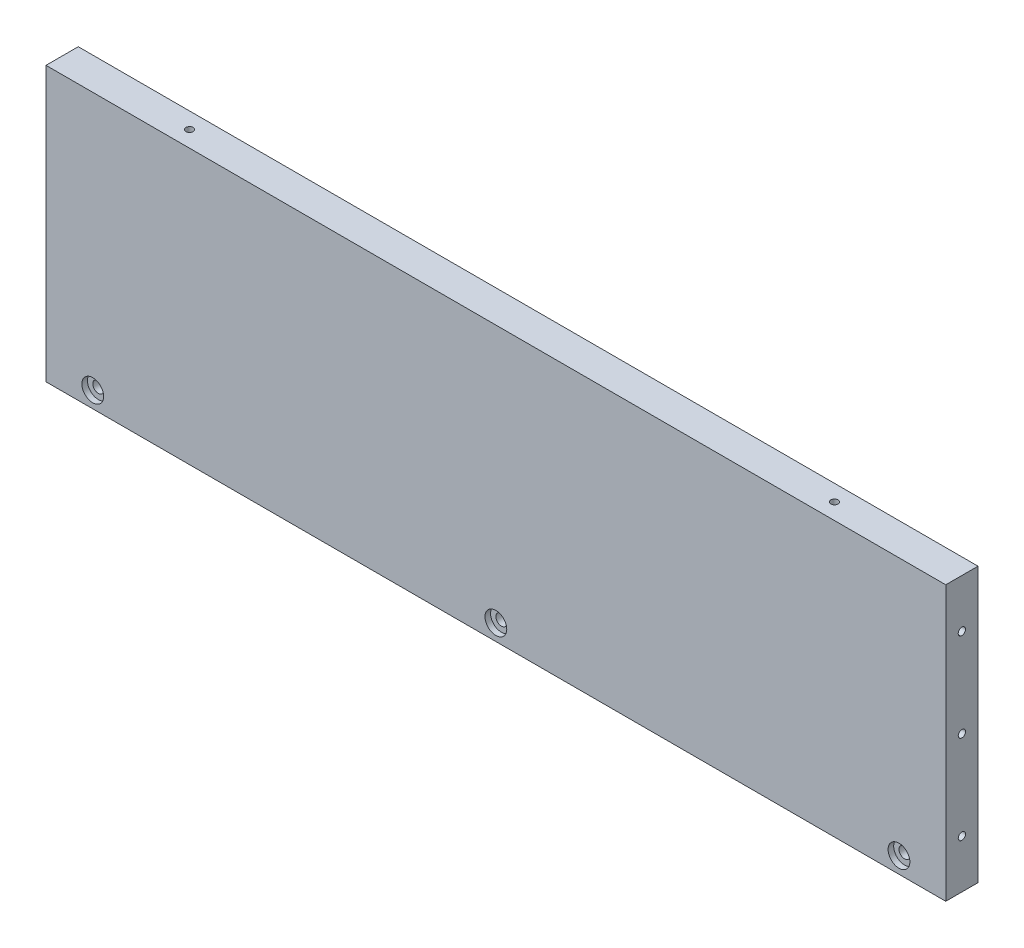
ISO-10303-21;
HEADER;
FILE_DESCRIPTION(('STEP AP214'),'2;1');
FILE_NAME('part.step','',(''),(''),'','','');
FILE_SCHEMA(('AUTOMOTIVE_DESIGN { 1 0 10303 214 1 1 1 1 }'));
ENDSEC;
DATA;
#1=APPLICATION_CONTEXT('core data for automotive mechanical design processes');
#2=APPLICATION_PROTOCOL_DEFINITION('international standard','automotive_design',2000,#1);
#3=PRODUCT_CONTEXT('',#1,'mechanical');
#4=PRODUCT('Part','Part','',(#3));
#5=PRODUCT_RELATED_PRODUCT_CATEGORY('part','',(#4));
#6=PRODUCT_DEFINITION_FORMATION('','',#4);
#7=PRODUCT_DEFINITION_CONTEXT('part definition',#1,'design');
#8=PRODUCT_DEFINITION('design','',#6,#7);
#9=PRODUCT_DEFINITION_SHAPE('','',#8);
#10=(LENGTH_UNIT() NAMED_UNIT(*) SI_UNIT(.MILLI.,.METRE.));
#11=(NAMED_UNIT(*) PLANE_ANGLE_UNIT() SI_UNIT($,.RADIAN.));
#12=(NAMED_UNIT(*) SI_UNIT($,.STERADIAN.) SOLID_ANGLE_UNIT());
#13=UNCERTAINTY_MEASURE_WITH_UNIT(LENGTH_MEASURE(1.E-05),#10,'distance_accuracy_value','');
#14=(GEOMETRIC_REPRESENTATION_CONTEXT(3) GLOBAL_UNCERTAINTY_ASSIGNED_CONTEXT((#13)) GLOBAL_UNIT_ASSIGNED_CONTEXT((#10,
#11,#12)) REPRESENTATION_CONTEXT('',''));
#15=CARTESIAN_POINT('',(0.,0.,0.));
#16=DIRECTION('',(0.,0.,1.));
#17=DIRECTION('',(1.,0.,0.));
#18=AXIS2_PLACEMENT_3D('',#15,#16,#17);
#19=CARTESIAN_POINT('',(-130.996216897856,78.0327868852459,10.));
#20=DIRECTION('',(1.,0.,0.));
#21=DIRECTION('',(0.,1.,0.));
#22=AXIS2_PLACEMENT_3D('',#19,#20,#21);
#23=PLANE('',#22);
#24=CARTESIAN_POINT('',(-130.996216897856,63.0327868852459,5.));
#25=DIRECTION('',(-1.,0.,0.));
#26=DIRECTION('',(0.,0.,1.));
#27=AXIS2_PLACEMENT_3D('',#24,#25,#26);
#28=CIRCLE('',#27,1.13029999999999);
#29=CARTESIAN_POINT('',(-130.996216897856,63.0327868852459,6.13029999999999));
#30=VERTEX_POINT('',#29);
#31=EDGE_CURVE('E167',#30,#30,#28,.T.);
#32=ORIENTED_EDGE('',*,*,#31,.F.);
#33=EDGE_LOOP('',(#32));
#34=FACE_BOUND('',#33,.T.);
#35=CARTESIAN_POINT('',(-130.996216897856,35.5327868852459,5.));
#36=DIRECTION('',(-1.,0.,0.));
#37=DIRECTION('',(0.,0.,1.));
#38=AXIS2_PLACEMENT_3D('',#35,#36,#37);
#39=CIRCLE('',#38,1.13029999999999);
#40=CARTESIAN_POINT('',(-130.996216897856,35.5327868852459,6.13029999999999));
#41=VERTEX_POINT('',#40);
#42=EDGE_CURVE('E175',#41,#41,#39,.T.);
#43=ORIENTED_EDGE('',*,*,#42,.F.);
#44=EDGE_LOOP('',(#43));
#45=FACE_BOUND('',#44,.T.);
#46=CARTESIAN_POINT('',(-130.996216897856,8.03278688524591,5.));
#47=DIRECTION('',(-1.,0.,0.));
#48=DIRECTION('',(0.,0.,1.));
#49=AXIS2_PLACEMENT_3D('',#46,#47,#48);
#50=CIRCLE('',#49,1.13029999999999);
#51=CARTESIAN_POINT('',(-130.996216897856,8.03278688524591,6.13029999999999));
#52=VERTEX_POINT('',#51);
#53=EDGE_CURVE('E183',#52,#52,#50,.T.);
#54=ORIENTED_EDGE('',*,*,#53,.F.);
#55=EDGE_LOOP('',(#54));
#56=FACE_BOUND('',#55,.T.);
#57=DIRECTION('',(0.,-1.,0.));
#58=VECTOR('',#57,1.);
#59=CARTESIAN_POINT('',(-130.996216897856,78.0327868852459,0.));
#60=LINE('',#59,#58);
#61=CARTESIAN_POINT('',(-130.996216897856,78.0327868852459,0.));
#62=VERTEX_POINT('',#61);
#63=CARTESIAN_POINT('',(-130.996216897856,-6.9672131147541,0.));
#64=VERTEX_POINT('',#63);
#65=EDGE_CURVE('E239',#62,#64,#60,.T.);
#66=ORIENTED_EDGE('',*,*,#65,.T.);
#67=DIRECTION('',(0.,0.,-1.));
#68=VECTOR('',#67,1.);
#69=CARTESIAN_POINT('',(-130.996216897856,-6.9672131147541,10.));
#70=LINE('',#69,#68);
#71=CARTESIAN_POINT('',(-130.996216897856,-6.9672131147541,10.));
#72=VERTEX_POINT('',#71);
#73=EDGE_CURVE('E11',#72,#64,#70,.T.);
#74=ORIENTED_EDGE('',*,*,#73,.F.);
#75=DIRECTION('',(0.,-1.,0.));
#76=VECTOR('',#75,1.);
#77=CARTESIAN_POINT('',(-130.996216897856,78.0327868852459,10.));
#78=LINE('',#77,#76);
#79=CARTESIAN_POINT('',(-130.996216897856,78.0327868852459,10.));
#80=VERTEX_POINT('',#79);
#81=EDGE_CURVE('E240',#80,#72,#78,.T.);
#82=ORIENTED_EDGE('',*,*,#81,.F.);
#83=DIRECTION('',(0.,0.,-1.));
#84=VECTOR('',#83,1.);
#85=CARTESIAN_POINT('',(-130.996216897856,78.0327868852459,10.));
#86=LINE('',#85,#84);
#87=EDGE_CURVE('E250',#80,#62,#86,.T.);
#88=ORIENTED_EDGE('',*,*,#87,.T.);
#89=EDGE_LOOP('',(#66,#74,#82,#88));
#90=FACE_BOUND('',#89,.T.);
#91=ADVANCED_FACE('F45',(#34,#45,#56,#90),#23,.F.);
#92=CARTESIAN_POINT('',(-130.996216897856,-6.9672131147541,10.));
#93=DIRECTION('',(0.,1.,0.));
#94=DIRECTION('',(0.,0.,1.));
#95=AXIS2_PLACEMENT_3D('',#92,#93,#94);
#96=PLANE('',#95);
#97=DIRECTION('',(1.,0.,0.));
#98=VECTOR('',#97,1.);
#99=CARTESIAN_POINT('',(-130.996216897856,-6.9672131147541,0.));
#100=LINE('',#99,#98);
#101=CARTESIAN_POINT('',(148.003783102144,-6.9672131147541,0.));
#102=VERTEX_POINT('',#101);
#103=EDGE_CURVE('E254',#64,#102,#100,.T.);
#104=ORIENTED_EDGE('',*,*,#103,.T.);
#105=DIRECTION('',(0.,0.,-1.));
#106=VECTOR('',#105,1.);
#107=CARTESIAN_POINT('',(148.003783102144,-6.9672131147541,10.));
#108=LINE('',#107,#106);
#109=CARTESIAN_POINT('',(148.003783102144,-6.9672131147541,10.));
#110=VERTEX_POINT('',#109);
#111=EDGE_CURVE('E54',#110,#102,#108,.T.);
#112=ORIENTED_EDGE('',*,*,#111,.F.);
#113=DIRECTION('',(1.,0.,0.));
#114=VECTOR('',#113,1.);
#115=CARTESIAN_POINT('',(-130.996216897856,-6.9672131147541,10.));
#116=LINE('',#115,#114);
#117=EDGE_CURVE('E93',#72,#110,#116,.T.);
#118=ORIENTED_EDGE('',*,*,#117,.F.);
#119=ORIENTED_EDGE('',*,*,#73,.T.);
#120=EDGE_LOOP('',(#104,#112,#118,#119));
#121=FACE_BOUND('',#120,.T.);
#122=ADVANCED_FACE('F285',(#121),#96,.F.);
#123=CARTESIAN_POINT('',(148.003783102144,78.0327868852459,10.));
#124=DIRECTION('',(-1.,0.,0.));
#125=DIRECTION('',(0.,-1.,0.));
#126=AXIS2_PLACEMENT_3D('',#123,#124,#125);
#127=PLANE('',#126);
#128=CARTESIAN_POINT('',(148.003783102144,63.0327868852458,5.));
#129=DIRECTION('',(1.,0.,0.));
#130=DIRECTION('',(0.,0.,-1.));
#131=AXIS2_PLACEMENT_3D('',#128,#129,#130);
#132=CIRCLE('',#131,1.13029999999999);
#133=CARTESIAN_POINT('',(148.003783102144,63.0327868852458,3.86970000000001));
#134=VERTEX_POINT('',#133);
#135=EDGE_CURVE('E143',#134,#134,#132,.T.);
#136=ORIENTED_EDGE('',*,*,#135,.F.);
#137=EDGE_LOOP('',(#136));
#138=FACE_BOUND('',#137,.T.);
#139=CARTESIAN_POINT('',(148.003783102144,35.5327868852458,5.));
#140=DIRECTION('',(1.,0.,0.));
#141=DIRECTION('',(0.,0.,-1.));
#142=AXIS2_PLACEMENT_3D('',#139,#140,#141);
#143=CIRCLE('',#142,1.13029999999999);
#144=CARTESIAN_POINT('',(148.003783102144,35.5327868852458,3.86970000000001));
#145=VERTEX_POINT('',#144);
#146=EDGE_CURVE('E151',#145,#145,#143,.T.);
#147=ORIENTED_EDGE('',*,*,#146,.F.);
#148=EDGE_LOOP('',(#147));
#149=FACE_BOUND('',#148,.T.);
#150=CARTESIAN_POINT('',(148.003783102144,8.03278688524579,5.));
#151=DIRECTION('',(1.,0.,0.));
#152=DIRECTION('',(0.,0.,-1.));
#153=AXIS2_PLACEMENT_3D('',#150,#151,#152);
#154=CIRCLE('',#153,1.13029999999999);
#155=CARTESIAN_POINT('',(148.003783102144,8.03278688524579,3.86970000000001));
#156=VERTEX_POINT('',#155);
#157=EDGE_CURVE('E159',#156,#156,#154,.T.);
#158=ORIENTED_EDGE('',*,*,#157,.F.);
#159=EDGE_LOOP('',(#158));
#160=FACE_BOUND('',#159,.T.);
#161=DIRECTION('',(0.,1.,0.));
#162=VECTOR('',#161,1.);
#163=CARTESIAN_POINT('',(148.003783102144,78.0327868852459,0.));
#164=LINE('',#163,#162);
#165=CARTESIAN_POINT('',(148.003783102144,78.0327868852459,0.));
#166=VERTEX_POINT('',#165);
#167=EDGE_CURVE('E80',#102,#166,#164,.T.);
#168=ORIENTED_EDGE('',*,*,#167,.T.);
#169=DIRECTION('',(0.,0.,-1.));
#170=VECTOR('',#169,1.);
#171=CARTESIAN_POINT('',(148.003783102144,78.0327868852459,10.));
#172=LINE('',#171,#170);
#173=CARTESIAN_POINT('',(148.003783102144,78.0327868852459,10.));
#174=VERTEX_POINT('',#173);
#175=EDGE_CURVE('E263',#174,#166,#172,.T.);
#176=ORIENTED_EDGE('',*,*,#175,.F.);
#177=DIRECTION('',(0.,1.,0.));
#178=VECTOR('',#177,1.);
#179=CARTESIAN_POINT('',(148.003783102144,78.0327868852459,10.));
#180=LINE('',#179,#178);
#181=EDGE_CURVE('E245',#110,#174,#180,.T.);
#182=ORIENTED_EDGE('',*,*,#181,.F.);
#183=ORIENTED_EDGE('',*,*,#111,.T.);
#184=EDGE_LOOP('',(#168,#176,#182,#183));
#185=FACE_BOUND('',#184,.T.);
#186=ADVANCED_FACE('F267',(#138,#149,#160,#185),#127,.F.);
#187=CARTESIAN_POINT('',(-130.996216897856,78.0327868852459,10.));
#188=DIRECTION('',(0.,-1.,0.));
#189=DIRECTION('',(0.,0.,-1.));
#190=AXIS2_PLACEMENT_3D('',#187,#188,#189);
#191=PLANE('',#190);
#192=CARTESIAN_POINT('',(-91.4962168978563,78.0327868852459,5.));
#193=DIRECTION('',(0.,1.,0.));
#194=DIRECTION('',(0.,0.,1.));
#195=AXIS2_PLACEMENT_3D('',#192,#193,#194);
#196=CIRCLE('',#195,1.13029999999999);
#197=CARTESIAN_POINT('',(-91.4962168978563,78.0327868852459,6.13029999999999));
#198=VERTEX_POINT('',#197);
#199=EDGE_CURVE('E130',#198,#198,#196,.T.);
#200=ORIENTED_EDGE('',*,*,#199,.F.);
#201=EDGE_LOOP('',(#200));
#202=FACE_BOUND('',#201,.T.);
#203=CARTESIAN_POINT('',(108.503783102144,78.0327868852459,5.));
#204=DIRECTION('',(0.,1.,0.));
#205=DIRECTION('',(0.,0.,1.));
#206=AXIS2_PLACEMENT_3D('',#203,#204,#205);
#207=CIRCLE('',#206,1.13029999999999);
#208=CARTESIAN_POINT('',(108.503783102144,78.0327868852459,6.13029999999999));
#209=VERTEX_POINT('',#208);
#210=EDGE_CURVE('E129',#209,#209,#207,.T.);
#211=ORIENTED_EDGE('',*,*,#210,.F.);
#212=EDGE_LOOP('',(#211));
#213=FACE_BOUND('',#212,.T.);
#214=DIRECTION('',(-1.,0.,0.));
#215=VECTOR('',#214,1.);
#216=CARTESIAN_POINT('',(-130.996216897856,78.0327868852459,0.));
#217=LINE('',#216,#215);
#218=EDGE_CURVE('E86',#166,#62,#217,.T.);
#219=ORIENTED_EDGE('',*,*,#218,.T.);
#220=ORIENTED_EDGE('',*,*,#87,.F.);
#221=DIRECTION('',(-1.,0.,0.));
#222=VECTOR('',#221,1.);
#223=CARTESIAN_POINT('',(-130.996216897856,78.0327868852459,10.));
#224=LINE('',#223,#222);
#225=EDGE_CURVE('E62',#174,#80,#224,.T.);
#226=ORIENTED_EDGE('',*,*,#225,.F.);
#227=ORIENTED_EDGE('',*,*,#175,.T.);
#228=EDGE_LOOP('',(#219,#220,#226,#227));
#229=FACE_BOUND('',#228,.T.);
#230=ADVANCED_FACE('F274',(#202,#213,#229),#191,.F.);
#231=CARTESIAN_POINT('',(0.,0.,10.));
#232=DIRECTION('',(0.,0.,1.));
#233=DIRECTION('',(1.,0.,0.));
#234=AXIS2_PLACEMENT_3D('',#231,#232,#233);
#235=PLANE('',#234);
#236=CARTESIAN_POINT('',(-116.496216897856,-1.96721311475409,10.));
#237=DIRECTION('',(0.,0.,1.));
#238=DIRECTION('',(1.,0.,0.));
#239=AXIS2_PLACEMENT_3D('',#236,#237,#238);
#240=CIRCLE('',#239,3.37311999999999);
#241=CARTESIAN_POINT('',(-113.123096897856,-1.96721311475409,10.));
#242=VERTEX_POINT('',#241);
#243=EDGE_CURVE('E191',#242,#242,#240,.T.);
#244=ORIENTED_EDGE('',*,*,#243,.F.);
#245=EDGE_LOOP('',(#244));
#246=FACE_BOUND('',#245,.T.);
#247=CARTESIAN_POINT('',(8.50378310214372,-1.96721311475409,10.));
#248=DIRECTION('',(0.,0.,1.));
#249=DIRECTION('',(1.,0.,0.));
#250=AXIS2_PLACEMENT_3D('',#247,#248,#249);
#251=CIRCLE('',#250,3.37311999999999);
#252=CARTESIAN_POINT('',(11.8769031021437,-1.96721311475409,10.));
#253=VERTEX_POINT('',#252);
#254=EDGE_CURVE('E207',#253,#253,#251,.T.);
#255=ORIENTED_EDGE('',*,*,#254,.F.);
#256=EDGE_LOOP('',(#255));
#257=FACE_BOUND('',#256,.T.);
#258=CARTESIAN_POINT('',(133.503783102144,-1.96721311475409,10.));
#259=DIRECTION('',(0.,0.,1.));
#260=DIRECTION('',(1.,0.,0.));
#261=AXIS2_PLACEMENT_3D('',#258,#259,#260);
#262=CIRCLE('',#261,3.37312000000001);
#263=CARTESIAN_POINT('',(136.876903102144,-1.96721311475409,10.));
#264=VERTEX_POINT('',#263);
#265=EDGE_CURVE('E223',#264,#264,#262,.T.);
#266=ORIENTED_EDGE('',*,*,#265,.F.);
#267=EDGE_LOOP('',(#266));
#268=FACE_BOUND('',#267,.T.);
#269=ORIENTED_EDGE('',*,*,#81,.T.);
#270=ORIENTED_EDGE('',*,*,#117,.T.);
#271=ORIENTED_EDGE('',*,*,#181,.T.);
#272=ORIENTED_EDGE('',*,*,#225,.T.);
#273=EDGE_LOOP('',(#269,#270,#271,#272));
#274=FACE_BOUND('',#273,.T.);
#275=ADVANCED_FACE('F276',(#246,#257,#268,#274),#235,.T.);
#276=CARTESIAN_POINT('',(0.,0.,0.));
#277=DIRECTION('',(0.,0.,1.));
#278=DIRECTION('',(1.,0.,0.));
#279=AXIS2_PLACEMENT_3D('',#276,#277,#278);
#280=PLANE('',#279);
#281=CARTESIAN_POINT('',(-116.496216897856,-1.96721311475409,0.));
#282=DIRECTION('',(0.,0.,1.));
#283=DIRECTION('',(1.,0.,0.));
#284=AXIS2_PLACEMENT_3D('',#281,#282,#283);
#285=CIRCLE('',#284,1.7272);
#286=CARTESIAN_POINT('',(-114.769016897856,-1.96721311475409,0.));
#287=VERTEX_POINT('',#286);
#288=EDGE_CURVE('E203',#287,#287,#285,.T.);
#289=ORIENTED_EDGE('',*,*,#288,.T.);
#290=EDGE_LOOP('',(#289));
#291=FACE_BOUND('',#290,.T.);
#292=CARTESIAN_POINT('',(8.50378310214372,-1.96721311475409,0.));
#293=DIRECTION('',(0.,0.,1.));
#294=DIRECTION('',(1.,0.,0.));
#295=AXIS2_PLACEMENT_3D('',#292,#293,#294);
#296=CIRCLE('',#295,1.7272);
#297=CARTESIAN_POINT('',(10.2309831021437,-1.96721311475409,0.));
#298=VERTEX_POINT('',#297);
#299=EDGE_CURVE('E219',#298,#298,#296,.T.);
#300=ORIENTED_EDGE('',*,*,#299,.T.);
#301=EDGE_LOOP('',(#300));
#302=FACE_BOUND('',#301,.T.);
#303=CARTESIAN_POINT('',(133.503783102144,-1.96721311475409,0.));
#304=DIRECTION('',(0.,0.,1.));
#305=DIRECTION('',(1.,0.,0.));
#306=AXIS2_PLACEMENT_3D('',#303,#304,#305);
#307=CIRCLE('',#306,1.72719999999998);
#308=CARTESIAN_POINT('',(135.230983102144,-1.96721311475409,0.));
#309=VERTEX_POINT('',#308);
#310=EDGE_CURVE('E235',#309,#309,#307,.T.);
#311=ORIENTED_EDGE('',*,*,#310,.T.);
#312=EDGE_LOOP('',(#311));
#313=FACE_BOUND('',#312,.T.);
#314=ORIENTED_EDGE('',*,*,#65,.F.);
#315=ORIENTED_EDGE('',*,*,#218,.F.);
#316=ORIENTED_EDGE('',*,*,#167,.F.);
#317=ORIENTED_EDGE('',*,*,#103,.F.);
#318=EDGE_LOOP('',(#314,#315,#316,#317));
#319=FACE_BOUND('',#318,.T.);
#320=ADVANCED_FACE('F270',(#291,#302,#313,#319),#280,.F.);
#321=CARTESIAN_POINT('',(133.503783102144,-1.96721311475409,10.));
#322=DIRECTION('',(0.,0.,1.));
#323=DIRECTION('',(1.,0.,0.));
#324=AXIS2_PLACEMENT_3D('',#321,#322,#323);
#325=CYLINDRICAL_SURFACE('',#324,1.7272);
#326=ORIENTED_EDGE('',*,*,#310,.F.);
#327=EDGE_LOOP('',(#326));
#328=FACE_BOUND('',#327,.T.);
#329=CARTESIAN_POINT('',(133.503783102144,-1.96721311475409,8.2728));
#330=DIRECTION('',(0.,0.,1.));
#331=DIRECTION('',(1.,0.,0.));
#332=AXIS2_PLACEMENT_3D('',#329,#330,#331);
#333=CIRCLE('',#332,1.72720000000001);
#334=CARTESIAN_POINT('',(135.230983102144,-1.96721311475409,8.2728));
#335=VERTEX_POINT('',#334);
#336=EDGE_CURVE('E231',#335,#335,#333,.T.);
#337=ORIENTED_EDGE('',*,*,#336,.T.);
#338=EDGE_LOOP('',(#337));
#339=FACE_BOUND('',#338,.T.);
#340=ADVANCED_FACE('F351',(#328,#339),#325,.F.);
#341=CARTESIAN_POINT('',(135.230983102144,-1.96721311475409,8.2728));
#342=DIRECTION('',(0.,0.,-1.));
#343=DIRECTION('',(-1.,0.,0.));
#344=AXIS2_PLACEMENT_3D('',#341,#342,#343);
#345=PLANE('',#344);
#346=ORIENTED_EDGE('',*,*,#336,.F.);
#347=EDGE_LOOP('',(#346));
#348=FACE_BOUND('',#347,.T.);
#349=CARTESIAN_POINT('',(133.503783102144,-1.96721311475409,8.2728));
#350=DIRECTION('',(0.,0.,1.));
#351=DIRECTION('',(1.,0.,0.));
#352=AXIS2_PLACEMENT_3D('',#349,#350,#351);
#353=CIRCLE('',#352,3.37312000000001);
#354=CARTESIAN_POINT('',(136.876903102144,-1.96721311475409,8.2728));
#355=VERTEX_POINT('',#354);
#356=EDGE_CURVE('E227',#355,#355,#353,.T.);
#357=ORIENTED_EDGE('',*,*,#356,.T.);
#358=EDGE_LOOP('',(#357));
#359=FACE_BOUND('',#358,.T.);
#360=ADVANCED_FACE('F347',(#348,#359),#345,.F.);
#361=CARTESIAN_POINT('',(133.503783102144,-1.96721311475409,10.));
#362=DIRECTION('',(0.,0.,1.));
#363=DIRECTION('',(1.,0.,0.));
#364=AXIS2_PLACEMENT_3D('',#361,#362,#363);
#365=CYLINDRICAL_SURFACE('',#364,3.37312000000001);
#366=ORIENTED_EDGE('',*,*,#356,.F.);
#367=EDGE_LOOP('',(#366));
#368=FACE_BOUND('',#367,.T.);
#369=ORIENTED_EDGE('',*,*,#265,.T.);
#370=EDGE_LOOP('',(#369));
#371=FACE_BOUND('',#370,.T.);
#372=ADVANCED_FACE('F343',(#368,#371),#365,.F.);
#373=CARTESIAN_POINT('',(8.50378310214372,-1.96721311475409,10.));
#374=DIRECTION('',(0.,0.,1.));
#375=DIRECTION('',(1.,0.,0.));
#376=AXIS2_PLACEMENT_3D('',#373,#374,#375);
#377=CYLINDRICAL_SURFACE('',#376,1.72720000000001);
#378=ORIENTED_EDGE('',*,*,#299,.F.);
#379=EDGE_LOOP('',(#378));
#380=FACE_BOUND('',#379,.T.);
#381=CARTESIAN_POINT('',(8.50378310214372,-1.96721311475409,8.2728));
#382=DIRECTION('',(0.,0.,1.));
#383=DIRECTION('',(1.,0.,0.));
#384=AXIS2_PLACEMENT_3D('',#381,#382,#383);
#385=CIRCLE('',#384,1.72720000000001);
#386=CARTESIAN_POINT('',(10.2309831021437,-1.96721311475409,8.2728));
#387=VERTEX_POINT('',#386);
#388=EDGE_CURVE('E215',#387,#387,#385,.T.);
#389=ORIENTED_EDGE('',*,*,#388,.T.);
#390=EDGE_LOOP('',(#389));
#391=FACE_BOUND('',#390,.T.);
#392=ADVANCED_FACE('F339',(#380,#391),#377,.F.);
#393=CARTESIAN_POINT('',(10.2309831021437,-1.96721311475409,8.2728));
#394=DIRECTION('',(0.,0.,-1.));
#395=DIRECTION('',(-1.,0.,0.));
#396=AXIS2_PLACEMENT_3D('',#393,#394,#395);
#397=PLANE('',#396);
#398=ORIENTED_EDGE('',*,*,#388,.F.);
#399=EDGE_LOOP('',(#398));
#400=FACE_BOUND('',#399,.T.);
#401=CARTESIAN_POINT('',(8.50378310214372,-1.96721311475409,8.2728));
#402=DIRECTION('',(0.,0.,1.));
#403=DIRECTION('',(1.,0.,0.));
#404=AXIS2_PLACEMENT_3D('',#401,#402,#403);
#405=CIRCLE('',#404,3.37311999999999);
#406=CARTESIAN_POINT('',(11.8769031021437,-1.96721311475409,8.2728));
#407=VERTEX_POINT('',#406);
#408=EDGE_CURVE('E211',#407,#407,#405,.T.);
#409=ORIENTED_EDGE('',*,*,#408,.T.);
#410=EDGE_LOOP('',(#409));
#411=FACE_BOUND('',#410,.T.);
#412=ADVANCED_FACE('F335',(#400,#411),#397,.F.);
#413=CARTESIAN_POINT('',(8.50378310214372,-1.96721311475409,10.));
#414=DIRECTION('',(0.,0.,1.));
#415=DIRECTION('',(1.,0.,0.));
#416=AXIS2_PLACEMENT_3D('',#413,#414,#415);
#417=CYLINDRICAL_SURFACE('',#416,3.37311999999999);
#418=ORIENTED_EDGE('',*,*,#408,.F.);
#419=EDGE_LOOP('',(#418));
#420=FACE_BOUND('',#419,.T.);
#421=ORIENTED_EDGE('',*,*,#254,.T.);
#422=EDGE_LOOP('',(#421));
#423=FACE_BOUND('',#422,.T.);
#424=ADVANCED_FACE('F331',(#420,#423),#417,.F.);
#425=CARTESIAN_POINT('',(-116.496216897856,-1.96721311475409,10.));
#426=DIRECTION('',(0.,0.,1.));
#427=DIRECTION('',(1.,0.,0.));
#428=AXIS2_PLACEMENT_3D('',#425,#426,#427);
#429=CYLINDRICAL_SURFACE('',#428,1.72720000000001);
#430=ORIENTED_EDGE('',*,*,#288,.F.);
#431=EDGE_LOOP('',(#430));
#432=FACE_BOUND('',#431,.T.);
#433=CARTESIAN_POINT('',(-116.496216897856,-1.96721311475409,8.2728));
#434=DIRECTION('',(0.,0.,1.));
#435=DIRECTION('',(1.,0.,0.));
#436=AXIS2_PLACEMENT_3D('',#433,#434,#435);
#437=CIRCLE('',#436,1.72720000000001);
#438=CARTESIAN_POINT('',(-114.769016897856,-1.96721311475409,8.2728));
#439=VERTEX_POINT('',#438);
#440=EDGE_CURVE('E199',#439,#439,#437,.T.);
#441=ORIENTED_EDGE('',*,*,#440,.T.);
#442=EDGE_LOOP('',(#441));
#443=FACE_BOUND('',#442,.T.);
#444=ADVANCED_FACE('F327',(#432,#443),#429,.F.);
#445=CARTESIAN_POINT('',(-114.769016897856,-1.96721311475409,8.2728));
#446=DIRECTION('',(0.,0.,-1.));
#447=DIRECTION('',(-1.,0.,0.));
#448=AXIS2_PLACEMENT_3D('',#445,#446,#447);
#449=PLANE('',#448);
#450=ORIENTED_EDGE('',*,*,#440,.F.);
#451=EDGE_LOOP('',(#450));
#452=FACE_BOUND('',#451,.T.);
#453=CARTESIAN_POINT('',(-116.496216897856,-1.96721311475409,8.2728));
#454=DIRECTION('',(0.,0.,1.));
#455=DIRECTION('',(1.,0.,0.));
#456=AXIS2_PLACEMENT_3D('',#453,#454,#455);
#457=CIRCLE('',#456,3.37311999999999);
#458=CARTESIAN_POINT('',(-113.123096897856,-1.96721311475409,8.2728));
#459=VERTEX_POINT('',#458);
#460=EDGE_CURVE('E195',#459,#459,#457,.T.);
#461=ORIENTED_EDGE('',*,*,#460,.T.);
#462=EDGE_LOOP('',(#461));
#463=FACE_BOUND('',#462,.T.);
#464=ADVANCED_FACE('F323',(#452,#463),#449,.F.);
#465=CARTESIAN_POINT('',(-116.496216897856,-1.96721311475409,10.));
#466=DIRECTION('',(0.,0.,1.));
#467=DIRECTION('',(1.,0.,0.));
#468=AXIS2_PLACEMENT_3D('',#465,#466,#467);
#469=CYLINDRICAL_SURFACE('',#468,3.37311999999999);
#470=ORIENTED_EDGE('',*,*,#460,.F.);
#471=EDGE_LOOP('',(#470));
#472=FACE_BOUND('',#471,.T.);
#473=ORIENTED_EDGE('',*,*,#243,.T.);
#474=EDGE_LOOP('',(#473));
#475=FACE_BOUND('',#474,.T.);
#476=ADVANCED_FACE('F315',(#472,#475),#469,.F.);
#477=CARTESIAN_POINT('',(-123.396216897856,8.03278688524591,5.));
#478=DIRECTION('',(-1.,0.,0.));
#479=DIRECTION('',(0.,0.,1.));
#480=AXIS2_PLACEMENT_3D('',#477,#478,#479);
#481=CONICAL_SURFACE('',#480,1.13029999999999,1.02974425867665);
#482=CARTESIAN_POINT('',(-122.717064140169,8.0327868852459,5.));
#483=VERTEX_POINT('',#482);
#484=VERTEX_LOOP('',#483);
#485=FACE_BOUND('',#484,.T.);
#486=CARTESIAN_POINT('',(-123.396216897856,8.03278688524591,5.));
#487=DIRECTION('',(-1.,0.,0.));
#488=DIRECTION('',(0.,0.,1.));
#489=AXIS2_PLACEMENT_3D('',#486,#487,#488);
#490=CIRCLE('',#489,1.13029999999999);
#491=CARTESIAN_POINT('',(-123.396216897856,8.03278688524591,6.13029999999999));
#492=VERTEX_POINT('',#491);
#493=EDGE_CURVE('E187',#492,#492,#490,.T.);
#494=ORIENTED_EDGE('',*,*,#493,.T.);
#495=EDGE_LOOP('',(#494));
#496=FACE_BOUND('',#495,.T.);
#497=ADVANCED_FACE('F305',(#485,#496),#481,.F.);
#498=CARTESIAN_POINT('',(-130.996216897856,8.03278688524591,5.));
#499=DIRECTION('',(-1.,0.,0.));
#500=DIRECTION('',(0.,0.,1.));
#501=AXIS2_PLACEMENT_3D('',#498,#499,#500);
#502=CYLINDRICAL_SURFACE('',#501,1.13029999999999);
#503=ORIENTED_EDGE('',*,*,#493,.F.);
#504=EDGE_LOOP('',(#503));
#505=FACE_BOUND('',#504,.T.);
#506=ORIENTED_EDGE('',*,*,#53,.T.);
#507=EDGE_LOOP('',(#506));
#508=FACE_BOUND('',#507,.T.);
#509=ADVANCED_FACE('F302',(#505,#508),#502,.F.);
#510=CARTESIAN_POINT('',(-123.396216897856,35.5327868852459,5.));
#511=DIRECTION('',(-1.,0.,0.));
#512=DIRECTION('',(0.,0.,1.));
#513=AXIS2_PLACEMENT_3D('',#510,#511,#512);
#514=CONICAL_SURFACE('',#513,1.13029999999999,1.02974425867665);
#515=CARTESIAN_POINT('',(-122.717064140169,35.5327868852459,5.));
#516=VERTEX_POINT('',#515);
#517=VERTEX_LOOP('',#516);
#518=FACE_BOUND('',#517,.T.);
#519=CARTESIAN_POINT('',(-123.396216897856,35.5327868852459,5.));
#520=DIRECTION('',(-1.,0.,0.));
#521=DIRECTION('',(0.,0.,1.));
#522=AXIS2_PLACEMENT_3D('',#519,#520,#521);
#523=CIRCLE('',#522,1.13029999999999);
#524=CARTESIAN_POINT('',(-123.396216897856,35.5327868852459,6.13029999999999));
#525=VERTEX_POINT('',#524);
#526=EDGE_CURVE('E179',#525,#525,#523,.T.);
#527=ORIENTED_EDGE('',*,*,#526,.T.);
#528=EDGE_LOOP('',(#527));
#529=FACE_BOUND('',#528,.T.);
#530=ADVANCED_FACE('F304',(#518,#529),#514,.F.);
#531=CARTESIAN_POINT('',(-130.996216897856,35.5327868852459,5.));
#532=DIRECTION('',(-1.,0.,0.));
#533=DIRECTION('',(0.,0.,1.));
#534=AXIS2_PLACEMENT_3D('',#531,#532,#533);
#535=CYLINDRICAL_SURFACE('',#534,1.13029999999999);
#536=ORIENTED_EDGE('',*,*,#526,.F.);
#537=EDGE_LOOP('',(#536));
#538=FACE_BOUND('',#537,.T.);
#539=ORIENTED_EDGE('',*,*,#42,.T.);
#540=EDGE_LOOP('',(#539));
#541=FACE_BOUND('',#540,.T.);
#542=ADVANCED_FACE('F312',(#538,#541),#535,.F.);
#543=CARTESIAN_POINT('',(-123.396216897856,63.0327868852459,5.));
#544=DIRECTION('',(-1.,0.,0.));
#545=DIRECTION('',(0.,0.,1.));
#546=AXIS2_PLACEMENT_3D('',#543,#544,#545);
#547=CONICAL_SURFACE('',#546,1.13029999999999,1.02974425867665);
#548=CARTESIAN_POINT('',(-122.717064140169,63.0327868852459,5.));
#549=VERTEX_POINT('',#548);
#550=VERTEX_LOOP('',#549);
#551=FACE_BOUND('',#550,.T.);
#552=CARTESIAN_POINT('',(-123.396216897856,63.0327868852459,5.));
#553=DIRECTION('',(-1.,0.,0.));
#554=DIRECTION('',(0.,0.,1.));
#555=AXIS2_PLACEMENT_3D('',#552,#553,#554);
#556=CIRCLE('',#555,1.13029999999999);
#557=CARTESIAN_POINT('',(-123.396216897856,63.0327868852459,6.13029999999999));
#558=VERTEX_POINT('',#557);
#559=EDGE_CURVE('E171',#558,#558,#556,.T.);
#560=ORIENTED_EDGE('',*,*,#559,.T.);
#561=EDGE_LOOP('',(#560));
#562=FACE_BOUND('',#561,.T.);
#563=ADVANCED_FACE('F454',(#551,#562),#547,.F.);
#564=CARTESIAN_POINT('',(-130.996216897856,63.0327868852459,5.));
#565=DIRECTION('',(-1.,0.,0.));
#566=DIRECTION('',(0.,0.,1.));
#567=AXIS2_PLACEMENT_3D('',#564,#565,#566);
#568=CYLINDRICAL_SURFACE('',#567,1.13029999999999);
#569=ORIENTED_EDGE('',*,*,#559,.F.);
#570=EDGE_LOOP('',(#569));
#571=FACE_BOUND('',#570,.T.);
#572=ORIENTED_EDGE('',*,*,#31,.T.);
#573=EDGE_LOOP('',(#572));
#574=FACE_BOUND('',#573,.T.);
#575=ADVANCED_FACE('F465',(#571,#574),#568,.F.);
#576=CARTESIAN_POINT('',(140.403783102144,8.03278688524579,5.));
#577=DIRECTION('',(1.,0.,0.));
#578=DIRECTION('',(0.,0.,-1.));
#579=AXIS2_PLACEMENT_3D('',#576,#577,#578);
#580=CONICAL_SURFACE('',#579,1.13029999999999,1.02974425867665);
#581=CARTESIAN_POINT('',(139.724630344457,8.03278688524579,5.));
#582=VERTEX_POINT('',#581);
#583=VERTEX_LOOP('',#582);
#584=FACE_BOUND('',#583,.T.);
#585=CARTESIAN_POINT('',(140.403783102144,8.03278688524579,5.));
#586=DIRECTION('',(1.,0.,0.));
#587=DIRECTION('',(0.,0.,-1.));
#588=AXIS2_PLACEMENT_3D('',#585,#586,#587);
#589=CIRCLE('',#588,1.13029999999999);
#590=CARTESIAN_POINT('',(140.403783102144,8.03278688524579,3.86970000000001));
#591=VERTEX_POINT('',#590);
#592=EDGE_CURVE('E163',#591,#591,#589,.T.);
#593=ORIENTED_EDGE('',*,*,#592,.T.);
#594=EDGE_LOOP('',(#593));
#595=FACE_BOUND('',#594,.T.);
#596=ADVANCED_FACE('F475',(#584,#595),#580,.F.);
#597=CARTESIAN_POINT('',(148.003783102144,8.03278688524579,5.));
#598=DIRECTION('',(1.,0.,0.));
#599=DIRECTION('',(0.,0.,-1.));
#600=AXIS2_PLACEMENT_3D('',#597,#598,#599);
#601=CYLINDRICAL_SURFACE('',#600,1.13029999999999);
#602=ORIENTED_EDGE('',*,*,#592,.F.);
#603=EDGE_LOOP('',(#602));
#604=FACE_BOUND('',#603,.T.);
#605=ORIENTED_EDGE('',*,*,#157,.T.);
#606=EDGE_LOOP('',(#605));
#607=FACE_BOUND('',#606,.T.);
#608=ADVANCED_FACE('F498',(#604,#607),#601,.F.);
#609=CARTESIAN_POINT('',(140.403783102144,35.5327868852458,5.));
#610=DIRECTION('',(1.,0.,0.));
#611=DIRECTION('',(0.,0.,-1.));
#612=AXIS2_PLACEMENT_3D('',#609,#610,#611);
#613=CONICAL_SURFACE('',#612,1.13029999999999,1.02974425867665);
#614=CARTESIAN_POINT('',(139.724630344457,35.5327868852458,5.));
#615=VERTEX_POINT('',#614);
#616=VERTEX_LOOP('',#615);
#617=FACE_BOUND('',#616,.T.);
#618=CARTESIAN_POINT('',(140.403783102144,35.5327868852458,5.));
#619=DIRECTION('',(1.,0.,0.));
#620=DIRECTION('',(0.,0.,-1.));
#621=AXIS2_PLACEMENT_3D('',#618,#619,#620);
#622=CIRCLE('',#621,1.13029999999999);
#623=CARTESIAN_POINT('',(140.403783102144,35.5327868852458,3.86970000000001));
#624=VERTEX_POINT('',#623);
#625=EDGE_CURVE('E155',#624,#624,#622,.T.);
#626=ORIENTED_EDGE('',*,*,#625,.T.);
#627=EDGE_LOOP('',(#626));
#628=FACE_BOUND('',#627,.T.);
#629=ADVANCED_FACE('F508',(#617,#628),#613,.F.);
#630=CARTESIAN_POINT('',(148.003783102144,35.5327868852458,5.));
#631=DIRECTION('',(1.,0.,0.));
#632=DIRECTION('',(0.,0.,-1.));
#633=AXIS2_PLACEMENT_3D('',#630,#631,#632);
#634=CYLINDRICAL_SURFACE('',#633,1.13029999999999);
#635=ORIENTED_EDGE('',*,*,#625,.F.);
#636=EDGE_LOOP('',(#635));
#637=FACE_BOUND('',#636,.T.);
#638=ORIENTED_EDGE('',*,*,#146,.T.);
#639=EDGE_LOOP('',(#638));
#640=FACE_BOUND('',#639,.T.);
#641=ADVANCED_FACE('F520',(#637,#640),#634,.F.);
#642=CARTESIAN_POINT('',(140.403783102144,63.0327868852458,5.));
#643=DIRECTION('',(1.,0.,0.));
#644=DIRECTION('',(0.,0.,-1.));
#645=AXIS2_PLACEMENT_3D('',#642,#643,#644);
#646=CONICAL_SURFACE('',#645,1.13029999999999,1.02974425867665);
#647=CARTESIAN_POINT('',(139.724630344457,63.0327868852458,5.));
#648=VERTEX_POINT('',#647);
#649=VERTEX_LOOP('',#648);
#650=FACE_BOUND('',#649,.T.);
#651=CARTESIAN_POINT('',(140.403783102144,63.0327868852458,5.));
#652=DIRECTION('',(1.,0.,0.));
#653=DIRECTION('',(0.,0.,-1.));
#654=AXIS2_PLACEMENT_3D('',#651,#652,#653);
#655=CIRCLE('',#654,1.13029999999999);
#656=CARTESIAN_POINT('',(140.403783102144,63.0327868852458,3.86970000000001));
#657=VERTEX_POINT('',#656);
#658=EDGE_CURVE('E147',#657,#657,#655,.T.);
#659=ORIENTED_EDGE('',*,*,#658,.T.);
#660=EDGE_LOOP('',(#659));
#661=FACE_BOUND('',#660,.T.);
#662=ADVANCED_FACE('F530',(#650,#661),#646,.F.);
#663=CARTESIAN_POINT('',(148.003783102144,63.0327868852458,5.));
#664=DIRECTION('',(1.,0.,0.));
#665=DIRECTION('',(0.,0.,-1.));
#666=AXIS2_PLACEMENT_3D('',#663,#664,#665);
#667=CYLINDRICAL_SURFACE('',#666,1.13029999999999);
#668=ORIENTED_EDGE('',*,*,#658,.F.);
#669=EDGE_LOOP('',(#668));
#670=FACE_BOUND('',#669,.T.);
#671=ORIENTED_EDGE('',*,*,#135,.T.);
#672=EDGE_LOOP('',(#671));
#673=FACE_BOUND('',#672,.T.);
#674=ADVANCED_FACE('F542',(#670,#673),#667,.F.);
#675=CARTESIAN_POINT('',(108.503783102144,70.4327868852459,5.));
#676=DIRECTION('',(0.,1.,0.));
#677=DIRECTION('',(0.,0.,1.));
#678=AXIS2_PLACEMENT_3D('',#675,#676,#677);
#679=CONICAL_SURFACE('',#678,1.13029999999999,1.02974425867665);
#680=CARTESIAN_POINT('',(108.503783102144,69.7536341275591,5.));
#681=VERTEX_POINT('',#680);
#682=VERTEX_LOOP('',#681);
#683=FACE_BOUND('',#682,.T.);
#684=CARTESIAN_POINT('',(108.503783102144,70.4327868852459,5.));
#685=DIRECTION('',(0.,1.,0.));
#686=DIRECTION('',(0.,0.,1.));
#687=AXIS2_PLACEMENT_3D('',#684,#685,#686);
#688=CIRCLE('',#687,1.13029999999999);
#689=CARTESIAN_POINT('',(108.503783102144,70.4327868852459,6.13029999999999));
#690=VERTEX_POINT('',#689);
#691=EDGE_CURVE('E135',#690,#690,#688,.T.);
#692=ORIENTED_EDGE('',*,*,#691,.T.);
#693=EDGE_LOOP('',(#692));
#694=FACE_BOUND('',#693,.T.);
#695=ADVANCED_FACE('F552',(#683,#694),#679,.F.);
#696=CARTESIAN_POINT('',(108.503783102144,78.0327868852459,5.));
#697=DIRECTION('',(0.,1.,0.));
#698=DIRECTION('',(0.,0.,1.));
#699=AXIS2_PLACEMENT_3D('',#696,#697,#698);
#700=CYLINDRICAL_SURFACE('',#699,1.13029999999999);
#701=ORIENTED_EDGE('',*,*,#691,.F.);
#702=EDGE_LOOP('',(#701));
#703=FACE_BOUND('',#702,.T.);
#704=ORIENTED_EDGE('',*,*,#210,.T.);
#705=EDGE_LOOP('',(#704));
#706=FACE_BOUND('',#705,.T.);
#707=ADVANCED_FACE('F122',(#703,#706),#700,.F.);
#708=CARTESIAN_POINT('',(-91.4962168978563,70.4327868852459,5.));
#709=DIRECTION('',(0.,1.,0.));
#710=DIRECTION('',(0.,0.,1.));
#711=AXIS2_PLACEMENT_3D('',#708,#709,#710);
#712=CONICAL_SURFACE('',#711,1.13029999999999,1.02974425867665);
#713=CARTESIAN_POINT('',(-91.4962168978563,69.7536341275591,5.));
#714=VERTEX_POINT('',#713);
#715=VERTEX_LOOP('',#714);
#716=FACE_BOUND('',#715,.T.);
#717=CARTESIAN_POINT('',(-91.4962168978563,70.4327868852459,5.));
#718=DIRECTION('',(0.,1.,0.));
#719=DIRECTION('',(0.,0.,1.));
#720=AXIS2_PLACEMENT_3D('',#717,#718,#719);
#721=CIRCLE('',#720,1.13029999999999);
#722=CARTESIAN_POINT('',(-91.4962168978563,70.4327868852459,6.13029999999999));
#723=VERTEX_POINT('',#722);
#724=EDGE_CURVE('E126',#723,#723,#721,.T.);
#725=ORIENTED_EDGE('',*,*,#724,.T.);
#726=EDGE_LOOP('',(#725));
#727=FACE_BOUND('',#726,.T.);
#728=ADVANCED_FACE('F118',(#716,#727),#712,.F.);
#729=CARTESIAN_POINT('',(-91.4962168978563,78.0327868852459,5.));
#730=DIRECTION('',(0.,1.,0.));
#731=DIRECTION('',(0.,0.,1.));
#732=AXIS2_PLACEMENT_3D('',#729,#730,#731);
#733=CYLINDRICAL_SURFACE('',#732,1.13029999999999);
#734=ORIENTED_EDGE('',*,*,#724,.F.);
#735=EDGE_LOOP('',(#734));
#736=FACE_BOUND('',#735,.T.);
#737=ORIENTED_EDGE('',*,*,#199,.T.);
#738=EDGE_LOOP('',(#737));
#739=FACE_BOUND('',#738,.T.);
#740=ADVANCED_FACE('F121',(#736,#739),#733,.F.);
#741=CLOSED_SHELL('',(#91,#122,#186,#230,#275,#320,#340,#360,#372,#392,#412,#424,#444,#464,#476,
#497,#509,#530,#542,#563,#575,#596,#608,#629,#641,#662,#674,#695,#707,#728,#740));
#742=MANIFOLD_SOLID_BREP('B2',#741);
#743=ADVANCED_BREP_SHAPE_REPRESENTATION('',(#18,#742),#14);
#744=SHAPE_DEFINITION_REPRESENTATION(#9,#743);
ENDSEC;
END-ISO-10303-21;
